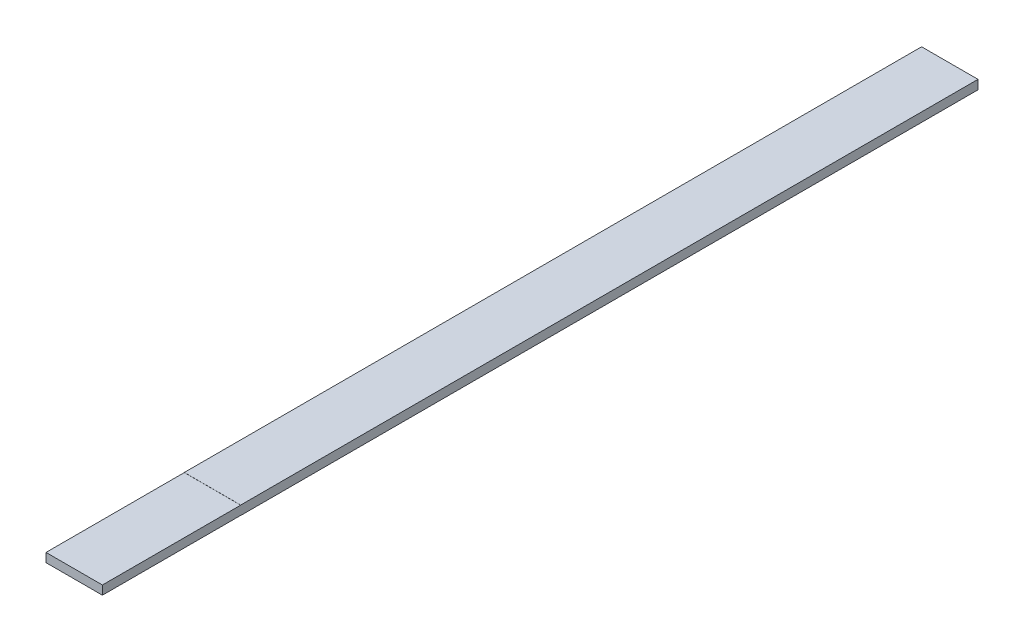
ISO-10303-21;
HEADER;
FILE_DESCRIPTION(('STEP AP214'),'2;1');
FILE_NAME('part.step','',(''),(''),'','','');
FILE_SCHEMA(('AUTOMOTIVE_DESIGN { 1 0 10303 214 1 1 1 1 }'));
ENDSEC;
DATA;
#1=APPLICATION_CONTEXT('core data for automotive mechanical design processes');
#2=APPLICATION_PROTOCOL_DEFINITION('international standard','automotive_design',2000,#1);
#3=PRODUCT_CONTEXT('',#1,'mechanical');
#4=PRODUCT('Part','Part','',(#3));
#5=PRODUCT_RELATED_PRODUCT_CATEGORY('part','',(#4));
#6=PRODUCT_DEFINITION_FORMATION('','',#4);
#7=PRODUCT_DEFINITION_CONTEXT('part definition',#1,'design');
#8=PRODUCT_DEFINITION('design','',#6,#7);
#9=PRODUCT_DEFINITION_SHAPE('','',#8);
#10=(LENGTH_UNIT() NAMED_UNIT(*) SI_UNIT(.MILLI.,.METRE.));
#11=(NAMED_UNIT(*) PLANE_ANGLE_UNIT() SI_UNIT($,.RADIAN.));
#12=(NAMED_UNIT(*) SI_UNIT($,.STERADIAN.) SOLID_ANGLE_UNIT());
#13=UNCERTAINTY_MEASURE_WITH_UNIT(LENGTH_MEASURE(1.E-05),#10,'distance_accuracy_value','');
#14=(GEOMETRIC_REPRESENTATION_CONTEXT(3) GLOBAL_UNCERTAINTY_ASSIGNED_CONTEXT((#13)) GLOBAL_UNIT_ASSIGNED_CONTEXT((#10,
#11,#12)) REPRESENTATION_CONTEXT('',''));
#15=CARTESIAN_POINT('',(0.,0.,0.));
#16=DIRECTION('',(0.,0.,1.));
#17=DIRECTION('',(1.,0.,0.));
#18=AXIS2_PLACEMENT_3D('',#15,#16,#17);
#19=CARTESIAN_POINT('',(18.,2.9,558.8));
#20=DIRECTION('',(-1.,0.,0.));
#21=DIRECTION('',(0.,0.,1.));
#22=AXIS2_PLACEMENT_3D('',#19,#20,#21);
#23=PLANE('',#22);
#24=DIRECTION('',(0.,0.,-1.));
#25=VECTOR('',#24,1.);
#26=CARTESIAN_POINT('',(18.,2.9,558.8));
#27=LINE('',#26,#25);
#28=CARTESIAN_POINT('',(18.,2.9,470.55));
#29=VERTEX_POINT('',#28);
#30=CARTESIAN_POINT('',(18.,2.9,0.));
#31=VERTEX_POINT('',#30);
#32=EDGE_CURVE('E11',#29,#31,#27,.T.);
#33=ORIENTED_EDGE('',*,*,#32,.F.);
#34=DIRECTION('',(0.,1.,0.));
#35=VECTOR('',#34,1.);
#36=CARTESIAN_POINT('',(18.,2.9,470.55));
#37=LINE('',#36,#35);
#38=CARTESIAN_POINT('',(18.,2.83142,470.55));
#39=VERTEX_POINT('',#38);
#40=EDGE_CURVE('E122',#39,#29,#37,.T.);
#41=ORIENTED_EDGE('',*,*,#40,.F.);
#42=DIRECTION('',(0.,0.,-1.));
#43=VECTOR('',#42,1.);
#44=CARTESIAN_POINT('',(18.,2.83142,558.8));
#45=LINE('',#44,#43);
#46=CARTESIAN_POINT('',(18.,2.83142,558.8));
#47=VERTEX_POINT('',#46);
#48=EDGE_CURVE('E105',#47,#39,#45,.T.);
#49=ORIENTED_EDGE('',*,*,#48,.F.);
#50=DIRECTION('',(0.,1.,0.));
#51=VECTOR('',#50,1.);
#52=CARTESIAN_POINT('',(18.,2.9,558.8));
#53=LINE('',#52,#51);
#54=CARTESIAN_POINT('',(18.,-2.83142,558.8));
#55=VERTEX_POINT('',#54);
#56=EDGE_CURVE('E145',#55,#47,#53,.T.);
#57=ORIENTED_EDGE('',*,*,#56,.F.);
#58=DIRECTION('',(0.,0.,1.));
#59=VECTOR('',#58,1.);
#60=CARTESIAN_POINT('',(18.,-2.83142,558.8));
#61=LINE('',#60,#59);
#62=CARTESIAN_POINT('',(18.,-2.83142,470.55));
#63=VERTEX_POINT('',#62);
#64=EDGE_CURVE('E61',#63,#55,#61,.T.);
#65=ORIENTED_EDGE('',*,*,#64,.F.);
#66=DIRECTION('',(0.,1.,0.));
#67=VECTOR('',#66,1.);
#68=CARTESIAN_POINT('',(18.,-2.9,470.55));
#69=LINE('',#68,#67);
#70=CARTESIAN_POINT('',(18.,-2.9,470.55));
#71=VERTEX_POINT('',#70);
#72=EDGE_CURVE('E127',#71,#63,#69,.T.);
#73=ORIENTED_EDGE('',*,*,#72,.F.);
#74=DIRECTION('',(0.,0.,-1.));
#75=VECTOR('',#74,1.);
#76=CARTESIAN_POINT('',(18.,-2.9,558.8));
#77=LINE('',#76,#75);
#78=CARTESIAN_POINT('',(18.,-2.9,0.));
#79=VERTEX_POINT('',#78);
#80=EDGE_CURVE('E150',#71,#79,#77,.T.);
#81=ORIENTED_EDGE('',*,*,#80,.T.);
#82=DIRECTION('',(0.,1.,0.));
#83=VECTOR('',#82,1.);
#84=CARTESIAN_POINT('',(18.,2.9,0.));
#85=LINE('',#84,#83);
#86=EDGE_CURVE('E141',#79,#31,#85,.T.);
#87=ORIENTED_EDGE('',*,*,#86,.T.);
#88=EDGE_LOOP('',(#33,#41,#49,#57,#65,#73,#81,#87));
#89=FACE_BOUND('',#88,.T.);
#90=ADVANCED_FACE('F38',(#89),#23,.F.);
#91=CARTESIAN_POINT('',(-18.,2.9,558.8));
#92=DIRECTION('',(0.,-1.,0.));
#93=DIRECTION('',(0.,0.,-1.));
#94=AXIS2_PLACEMENT_3D('',#91,#92,#93);
#95=PLANE('',#94);
#96=DIRECTION('',(0.,0.,-1.));
#97=VECTOR('',#96,1.);
#98=CARTESIAN_POINT('',(-18.,2.9,558.8));
#99=LINE('',#98,#97);
#100=CARTESIAN_POINT('',(-18.,2.9,470.55));
#101=VERTEX_POINT('',#100);
#102=CARTESIAN_POINT('',(-18.,2.9,0.));
#103=VERTEX_POINT('',#102);
#104=EDGE_CURVE('E46',#101,#103,#99,.T.);
#105=ORIENTED_EDGE('',*,*,#104,.F.);
#106=DIRECTION('',(1.,0.,0.));
#107=VECTOR('',#106,1.);
#108=CARTESIAN_POINT('',(-18.,2.9,470.55));
#109=LINE('',#108,#107);
#110=EDGE_CURVE('E108',#101,#29,#109,.T.);
#111=ORIENTED_EDGE('',*,*,#110,.T.);
#112=ORIENTED_EDGE('',*,*,#32,.T.);
#113=DIRECTION('',(-1.,0.,0.));
#114=VECTOR('',#113,1.);
#115=CARTESIAN_POINT('',(-18.,2.9,0.));
#116=LINE('',#115,#114);
#117=EDGE_CURVE('E153',#31,#103,#116,.T.);
#118=ORIENTED_EDGE('',*,*,#117,.T.);
#119=EDGE_LOOP('',(#105,#111,#112,#118));
#120=FACE_BOUND('',#119,.T.);
#121=ADVANCED_FACE('F171',(#120),#95,.F.);
#122=CARTESIAN_POINT('',(-18.,2.9,558.8));
#123=DIRECTION('',(1.,0.,0.));
#124=DIRECTION('',(0.,0.,-1.));
#125=AXIS2_PLACEMENT_3D('',#122,#123,#124);
#126=PLANE('',#125);
#127=DIRECTION('',(0.,0.,-1.));
#128=VECTOR('',#127,1.);
#129=CARTESIAN_POINT('',(-18.,2.83142,558.8));
#130=LINE('',#129,#128);
#131=CARTESIAN_POINT('',(-18.,2.83142,558.8));
#132=VERTEX_POINT('',#131);
#133=CARTESIAN_POINT('',(-18.,2.83142,470.55));
#134=VERTEX_POINT('',#133);
#135=EDGE_CURVE('E53',#132,#134,#130,.T.);
#136=ORIENTED_EDGE('',*,*,#135,.T.);
#137=DIRECTION('',(0.,1.,0.));
#138=VECTOR('',#137,1.);
#139=CARTESIAN_POINT('',(-18.,2.9,470.55));
#140=LINE('',#139,#138);
#141=EDGE_CURVE('E112',#134,#101,#140,.T.);
#142=ORIENTED_EDGE('',*,*,#141,.T.);
#143=ORIENTED_EDGE('',*,*,#104,.T.);
#144=DIRECTION('',(0.,-1.,0.));
#145=VECTOR('',#144,1.);
#146=CARTESIAN_POINT('',(-18.,2.9,0.));
#147=LINE('',#146,#145);
#148=CARTESIAN_POINT('',(-18.,-2.9,0.));
#149=VERTEX_POINT('',#148);
#150=EDGE_CURVE('E156',#103,#149,#147,.T.);
#151=ORIENTED_EDGE('',*,*,#150,.T.);
#152=DIRECTION('',(0.,0.,-1.));
#153=VECTOR('',#152,1.);
#154=CARTESIAN_POINT('',(-18.,-2.9,558.8));
#155=LINE('',#154,#153);
#156=CARTESIAN_POINT('',(-18.,-2.9,470.55));
#157=VERTEX_POINT('',#156);
#158=EDGE_CURVE('E163',#157,#149,#155,.T.);
#159=ORIENTED_EDGE('',*,*,#158,.F.);
#160=DIRECTION('',(0.,1.,0.));
#161=VECTOR('',#160,1.);
#162=CARTESIAN_POINT('',(-18.,-2.9,470.55));
#163=LINE('',#162,#161);
#164=CARTESIAN_POINT('',(-18.,-2.83142,470.55));
#165=VERTEX_POINT('',#164);
#166=EDGE_CURVE('E130',#157,#165,#163,.T.);
#167=ORIENTED_EDGE('',*,*,#166,.T.);
#168=DIRECTION('',(0.,0.,1.));
#169=VECTOR('',#168,1.);
#170=CARTESIAN_POINT('',(-18.,-2.83142,558.8));
#171=LINE('',#170,#169);
#172=CARTESIAN_POINT('',(-18.,-2.83142,558.8));
#173=VERTEX_POINT('',#172);
#174=EDGE_CURVE('E133',#165,#173,#171,.T.);
#175=ORIENTED_EDGE('',*,*,#174,.T.);
#176=DIRECTION('',(0.,-1.,0.));
#177=VECTOR('',#176,1.);
#178=CARTESIAN_POINT('',(-18.,2.9,558.8));
#179=LINE('',#178,#177);
#180=EDGE_CURVE('E121',#132,#173,#179,.T.);
#181=ORIENTED_EDGE('',*,*,#180,.F.);
#182=EDGE_LOOP('',(#136,#142,#143,#151,#159,#167,#175,#181));
#183=FACE_BOUND('',#182,.T.);
#184=ADVANCED_FACE('F119',(#183),#126,.F.);
#185=CARTESIAN_POINT('',(-18.,-2.9,558.8));
#186=DIRECTION('',(0.,1.,0.));
#187=DIRECTION('',(0.,0.,1.));
#188=AXIS2_PLACEMENT_3D('',#185,#186,#187);
#189=PLANE('',#188);
#190=ORIENTED_EDGE('',*,*,#80,.F.);
#191=DIRECTION('',(1.,0.,0.));
#192=VECTOR('',#191,1.);
#193=CARTESIAN_POINT('',(-18.,-2.9,470.55));
#194=LINE('',#193,#192);
#195=EDGE_CURVE('E135',#157,#71,#194,.T.);
#196=ORIENTED_EDGE('',*,*,#195,.F.);
#197=ORIENTED_EDGE('',*,*,#158,.T.);
#198=DIRECTION('',(1.,0.,0.));
#199=VECTOR('',#198,1.);
#200=CARTESIAN_POINT('',(-18.,-2.9,0.));
#201=LINE('',#200,#199);
#202=EDGE_CURVE('E148',#149,#79,#201,.T.);
#203=ORIENTED_EDGE('',*,*,#202,.T.);
#204=EDGE_LOOP('',(#190,#196,#197,#203));
#205=FACE_BOUND('',#204,.T.);
#206=ADVANCED_FACE('F178',(#205),#189,.F.);
#207=CARTESIAN_POINT('',(18.,-2.9,558.8));
#208=DIRECTION('',(0.,0.,1.));
#209=DIRECTION('',(1.,0.,0.));
#210=AXIS2_PLACEMENT_3D('',#207,#208,#209);
#211=PLANE('',#210);
#212=DIRECTION('',(1.,0.,0.));
#213=VECTOR('',#212,1.);
#214=CARTESIAN_POINT('',(-18.,2.83142,558.8));
#215=LINE('',#214,#213);
#216=EDGE_CURVE('E109',#132,#47,#215,.T.);
#217=ORIENTED_EDGE('',*,*,#216,.F.);
#218=ORIENTED_EDGE('',*,*,#180,.T.);
#219=DIRECTION('',(1.,0.,0.));
#220=VECTOR('',#219,1.);
#221=CARTESIAN_POINT('',(-18.,-2.83142,558.8));
#222=LINE('',#221,#220);
#223=EDGE_CURVE('E139',#173,#55,#222,.T.);
#224=ORIENTED_EDGE('',*,*,#223,.T.);
#225=ORIENTED_EDGE('',*,*,#56,.T.);
#226=EDGE_LOOP('',(#217,#218,#224,#225));
#227=FACE_BOUND('',#226,.T.);
#228=ADVANCED_FACE('F187',(#227),#211,.T.);
#229=CARTESIAN_POINT('',(18.,-2.9,0.));
#230=DIRECTION('',(0.,0.,1.));
#231=DIRECTION('',(1.,0.,0.));
#232=AXIS2_PLACEMENT_3D('',#229,#230,#231);
#233=PLANE('',#232);
#234=ORIENTED_EDGE('',*,*,#86,.F.);
#235=ORIENTED_EDGE('',*,*,#202,.F.);
#236=ORIENTED_EDGE('',*,*,#150,.F.);
#237=ORIENTED_EDGE('',*,*,#117,.F.);
#238=EDGE_LOOP('',(#234,#235,#236,#237));
#239=FACE_BOUND('',#238,.T.);
#240=ADVANCED_FACE('F175',(#239),#233,.F.);
#241=CARTESIAN_POINT('',(-18.,-2.83142,558.8));
#242=DIRECTION('',(0.,1.,0.));
#243=DIRECTION('',(0.,0.,1.));
#244=AXIS2_PLACEMENT_3D('',#241,#242,#243);
#245=PLANE('',#244);
#246=ORIENTED_EDGE('',*,*,#64,.T.);
#247=ORIENTED_EDGE('',*,*,#223,.F.);
#248=ORIENTED_EDGE('',*,*,#174,.F.);
#249=DIRECTION('',(1.,0.,0.));
#250=VECTOR('',#249,1.);
#251=CARTESIAN_POINT('',(-18.,-2.83142,470.55));
#252=LINE('',#251,#250);
#253=EDGE_CURVE('E142',#165,#63,#252,.T.);
#254=ORIENTED_EDGE('',*,*,#253,.T.);
#255=EDGE_LOOP('',(#246,#247,#248,#254));
#256=FACE_BOUND('',#255,.T.);
#257=ADVANCED_FACE('F184',(#256),#245,.F.);
#258=CARTESIAN_POINT('',(-18.,-2.9,470.55));
#259=DIRECTION('',(0.,0.,-1.));
#260=DIRECTION('',(-1.,0.,0.));
#261=AXIS2_PLACEMENT_3D('',#258,#259,#260);
#262=PLANE('',#261);
#263=ORIENTED_EDGE('',*,*,#72,.T.);
#264=ORIENTED_EDGE('',*,*,#253,.F.);
#265=ORIENTED_EDGE('',*,*,#166,.F.);
#266=ORIENTED_EDGE('',*,*,#195,.T.);
#267=EDGE_LOOP('',(#263,#264,#265,#266));
#268=FACE_BOUND('',#267,.T.);
#269=ADVANCED_FACE('F182',(#268),#262,.F.);
#270=CARTESIAN_POINT('',(-18.,2.9,470.55));
#271=DIRECTION('',(0.,0.,-1.));
#272=DIRECTION('',(-1.,0.,0.));
#273=AXIS2_PLACEMENT_3D('',#270,#271,#272);
#274=PLANE('',#273);
#275=ORIENTED_EDGE('',*,*,#40,.T.);
#276=ORIENTED_EDGE('',*,*,#110,.F.);
#277=ORIENTED_EDGE('',*,*,#141,.F.);
#278=DIRECTION('',(1.,0.,0.));
#279=VECTOR('',#278,1.);
#280=CARTESIAN_POINT('',(-18.,2.83142,470.55));
#281=LINE('',#280,#279);
#282=EDGE_CURVE('E101',#134,#39,#281,.T.);
#283=ORIENTED_EDGE('',*,*,#282,.T.);
#284=EDGE_LOOP('',(#275,#276,#277,#283));
#285=FACE_BOUND('',#284,.T.);
#286=ADVANCED_FACE('F113',(#285),#274,.F.);
#287=CARTESIAN_POINT('',(-18.,2.83142,558.8));
#288=DIRECTION('',(0.,-1.,0.));
#289=DIRECTION('',(0.,0.,-1.));
#290=AXIS2_PLACEMENT_3D('',#287,#288,#289);
#291=PLANE('',#290);
#292=ORIENTED_EDGE('',*,*,#48,.T.);
#293=ORIENTED_EDGE('',*,*,#282,.F.);
#294=ORIENTED_EDGE('',*,*,#135,.F.);
#295=ORIENTED_EDGE('',*,*,#216,.T.);
#296=EDGE_LOOP('',(#292,#293,#294,#295));
#297=FACE_BOUND('',#296,.T.);
#298=ADVANCED_FACE('F103',(#297),#291,.F.);
#299=CLOSED_SHELL('',(#90,#121,#184,#206,#228,#240,#257,#269,#286,#298));
#300=MANIFOLD_SOLID_BREP('B2',#299);
#301=ADVANCED_BREP_SHAPE_REPRESENTATION('',(#18,#300),#14);
#302=SHAPE_DEFINITION_REPRESENTATION(#9,#301);
ENDSEC;
END-ISO-10303-21;
